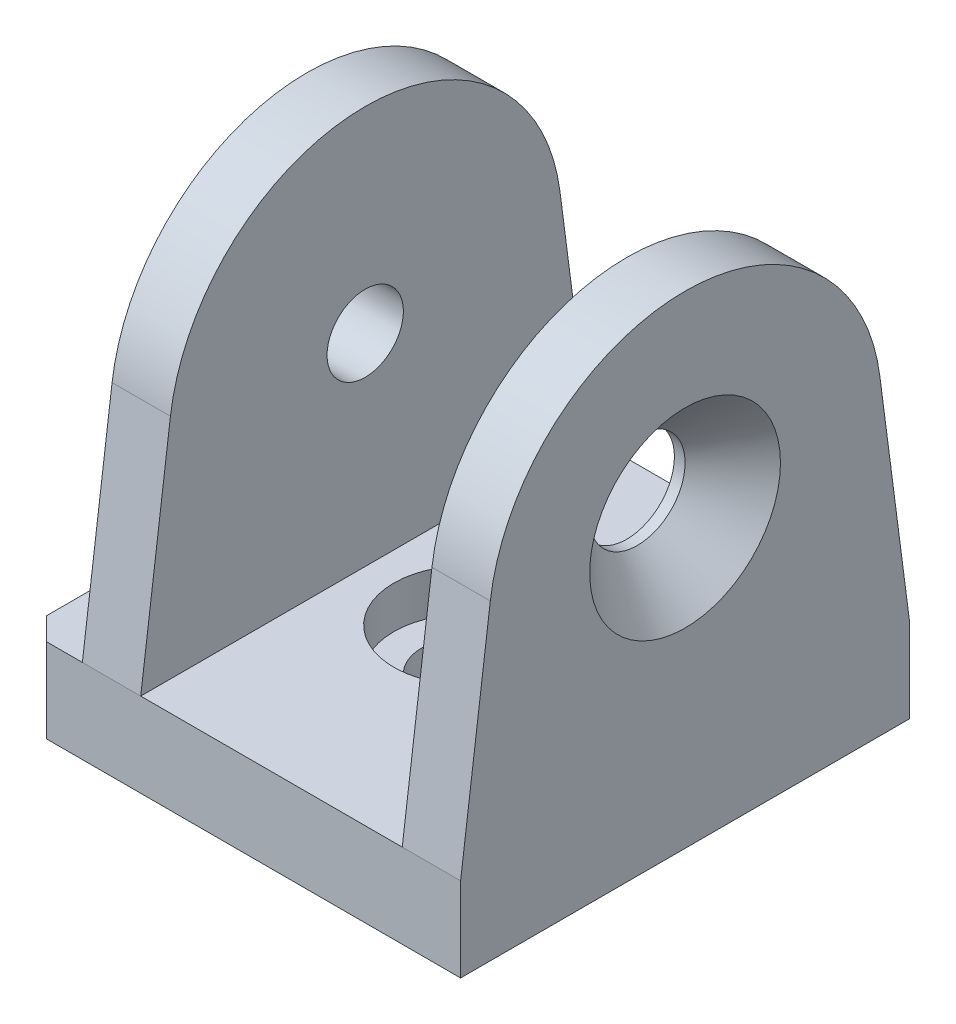
ISO-10303-21;
HEADER;
FILE_DESCRIPTION(('STEP AP214'),'2;1');
FILE_NAME('part.step','',(''),(''),'','','');
FILE_SCHEMA(('AUTOMOTIVE_DESIGN { 1 0 10303 214 1 1 1 1 }'));
ENDSEC;
DATA;
#1=APPLICATION_CONTEXT('core data for automotive mechanical design processes');
#2=APPLICATION_PROTOCOL_DEFINITION('international standard','automotive_design',2000,#1);
#3=PRODUCT_CONTEXT('',#1,'mechanical');
#4=PRODUCT('Part','Part','',(#3));
#5=PRODUCT_RELATED_PRODUCT_CATEGORY('part','',(#4));
#6=PRODUCT_DEFINITION_FORMATION('','',#4);
#7=PRODUCT_DEFINITION_CONTEXT('part definition',#1,'design');
#8=PRODUCT_DEFINITION('design','',#6,#7);
#9=PRODUCT_DEFINITION_SHAPE('','',#8);
#10=(LENGTH_UNIT() NAMED_UNIT(*) SI_UNIT(.MILLI.,.METRE.));
#11=(NAMED_UNIT(*) PLANE_ANGLE_UNIT() SI_UNIT($,.RADIAN.));
#12=(NAMED_UNIT(*) SI_UNIT($,.STERADIAN.) SOLID_ANGLE_UNIT());
#13=UNCERTAINTY_MEASURE_WITH_UNIT(LENGTH_MEASURE(1.E-05),#10,'distance_accuracy_value','');
#14=(GEOMETRIC_REPRESENTATION_CONTEXT(3) GLOBAL_UNCERTAINTY_ASSIGNED_CONTEXT((#13)) GLOBAL_UNIT_ASSIGNED_CONTEXT((#10,
#11,#12)) REPRESENTATION_CONTEXT('',''));
#15=CARTESIAN_POINT('',(0.,0.,0.));
#16=DIRECTION('',(0.,0.,1.));
#17=DIRECTION('',(1.,0.,0.));
#18=AXIS2_PLACEMENT_3D('',#15,#16,#17);
#19=CARTESIAN_POINT('',(-14.25,27.7667495892119,-17.3525746302907));
#20=DIRECTION('',(0.,0.129528547954965,-0.991575693159468));
#21=DIRECTION('',(0.,0.991575693159468,0.129528547954965));
#22=AXIS2_PLACEMENT_3D('',#19,#20,#21);
#23=PLANE('',#22);
#24=DIRECTION('',(0.,-0.991575693159468,-0.129528547954965));
#25=VECTOR('',#24,1.);
#26=CARTESIAN_POINT('',(14.25,27.7667495892119,-17.3525746302907));
#27=LINE('',#26,#25);
#28=CARTESIAN_POINT('',(14.25,27.7667495892119,-17.3525746302907));
#29=VERTEX_POINT('',#28);
#30=CARTESIAN_POINT('',(14.25,7.5,-20.));
#31=VERTEX_POINT('',#30);
#32=EDGE_CURVE('E145',#29,#31,#27,.T.);
#33=ORIENTED_EDGE('',*,*,#32,.F.);
#34=DIRECTION('',(1.,0.,0.));
#35=VECTOR('',#34,1.);
#36=CARTESIAN_POINT('',(-14.25,27.7667495892119,-17.3525746302907));
#37=LINE('',#36,#35);
#38=CARTESIAN_POINT('',(19.45,27.7667495892119,-17.3525746302907));
#39=VERTEX_POINT('',#38);
#40=EDGE_CURVE('E190',#29,#39,#37,.T.);
#41=ORIENTED_EDGE('',*,*,#40,.T.);
#42=DIRECTION('',(0.,0.991575693159467,0.129528547954965));
#43=VECTOR('',#42,1.);
#44=CARTESIAN_POINT('',(19.45,27.7667495892119,-17.3525746302907));
#45=LINE('',#44,#43);
#46=CARTESIAN_POINT('',(19.45,7.5,-20.));
#47=VERTEX_POINT('',#46);
#48=EDGE_CURVE('E258',#47,#39,#45,.T.);
#49=ORIENTED_EDGE('',*,*,#48,.F.);
#50=DIRECTION('',(-1.,0.,0.));
#51=VECTOR('',#50,1.);
#52=CARTESIAN_POINT('',(19.45,7.5,-20.));
#53=LINE('',#52,#51);
#54=EDGE_CURVE('E211',#47,#31,#53,.T.);
#55=ORIENTED_EDGE('',*,*,#54,.T.);
#56=EDGE_LOOP('',(#33,#41,#49,#55));
#57=FACE_BOUND('',#56,.T.);
#58=ADVANCED_FACE('F39',(#57),#23,.T.);
#59=CARTESIAN_POINT('',(-14.25,25.5,0.));
#60=DIRECTION('',(1.,0.,0.));
#61=DIRECTION('',(0.,0.,-1.));
#62=AXIS2_PLACEMENT_3D('',#59,#60,#61);
#63=CYLINDRICAL_SURFACE('',#62,17.5);
#64=DIRECTION('',(1.,0.,0.));
#65=VECTOR('',#64,1.);
#66=CARTESIAN_POINT('',(-14.25,27.7667495892119,17.3525746302907));
#67=LINE('',#66,#65);
#68=CARTESIAN_POINT('',(-14.25,27.7667495892119,17.3525746302907));
#69=VERTEX_POINT('',#68);
#70=CARTESIAN_POINT('',(-9.05000000000001,27.7667495892119,17.3525746302907));
#71=VERTEX_POINT('',#70);
#72=EDGE_CURVE('E178',#69,#71,#67,.T.);
#73=ORIENTED_EDGE('',*,*,#72,.T.);
#74=CARTESIAN_POINT('',(-9.05000000000001,25.5,0.));
#75=DIRECTION('',(-1.,0.,0.));
#76=DIRECTION('',(0.,-1.,0.));
#77=AXIS2_PLACEMENT_3D('',#74,#75,#76);
#78=CIRCLE('',#77,17.5);
#79=CARTESIAN_POINT('',(-9.05000000000001,27.7667495892119,-17.3525746302907));
#80=VERTEX_POINT('',#79);
#81=EDGE_CURVE('E149',#80,#71,#78,.F.);
#82=ORIENTED_EDGE('',*,*,#81,.F.);
#83=CARTESIAN_POINT('',(-14.25,27.7667495892119,-17.3525746302907));
#84=VERTEX_POINT('',#83);
#85=EDGE_CURVE('E187',#84,#80,#37,.T.);
#86=ORIENTED_EDGE('',*,*,#85,.F.);
#87=CARTESIAN_POINT('',(-14.25,25.5,0.));
#88=DIRECTION('',(1.,0.,0.));
#89=DIRECTION('',(0.,0.,1.));
#90=AXIS2_PLACEMENT_3D('',#87,#88,#89);
#91=CIRCLE('',#90,17.5);
#92=EDGE_CURVE('E313',#84,#69,#91,.T.);
#93=ORIENTED_EDGE('',*,*,#92,.T.);
#94=EDGE_LOOP('',(#73,#82,#86,#93));
#95=FACE_BOUND('',#94,.T.);
#96=ADVANCED_FACE('F273',(#95),#63,.T.);
#97=CARTESIAN_POINT('',(-14.25,7.5,20.));
#98=DIRECTION('',(0.,0.129528547954964,0.991575693159468));
#99=DIRECTION('',(0.,-0.991575693159468,0.129528547954964));
#100=AXIS2_PLACEMENT_3D('',#97,#98,#99);
#101=PLANE('',#100);
#102=DIRECTION('',(0.,0.991575693159468,-0.129528547954964));
#103=VECTOR('',#102,1.);
#104=CARTESIAN_POINT('',(14.25,7.5,20.));
#105=LINE('',#104,#103);
#106=CARTESIAN_POINT('',(14.25,7.5,20.));
#107=VERTEX_POINT('',#106);
#108=CARTESIAN_POINT('',(14.25,27.7667495892119,17.3525746302907));
#109=VERTEX_POINT('',#108);
#110=EDGE_CURVE('E142',#107,#109,#105,.T.);
#111=ORIENTED_EDGE('',*,*,#110,.F.);
#112=DIRECTION('',(1.,0.,0.));
#113=VECTOR('',#112,1.);
#114=CARTESIAN_POINT('',(-14.25,7.5,20.));
#115=LINE('',#114,#113);
#116=CARTESIAN_POINT('',(19.45,7.5,20.));
#117=VERTEX_POINT('',#116);
#118=EDGE_CURVE('E167',#107,#117,#115,.T.);
#119=ORIENTED_EDGE('',*,*,#118,.T.);
#120=DIRECTION('',(0.,-0.991575693159467,0.129528547954964));
#121=VECTOR('',#120,1.);
#122=CARTESIAN_POINT('',(19.45,7.5,20.));
#123=LINE('',#122,#121);
#124=CARTESIAN_POINT('',(19.45,27.7667495892119,17.3525746302907));
#125=VERTEX_POINT('',#124);
#126=EDGE_CURVE('E184',#125,#117,#123,.T.);
#127=ORIENTED_EDGE('',*,*,#126,.F.);
#128=EDGE_CURVE('E169',#109,#125,#67,.T.);
#129=ORIENTED_EDGE('',*,*,#128,.F.);
#130=EDGE_LOOP('',(#111,#119,#127,#129));
#131=FACE_BOUND('',#130,.T.);
#132=ADVANCED_FACE('F165',(#131),#101,.T.);
#133=CARTESIAN_POINT('',(0.,7.5,0.));
#134=DIRECTION('',(0.,1.,0.));
#135=DIRECTION('',(0.,0.,1.));
#136=AXIS2_PLACEMENT_3D('',#133,#134,#135);
#137=PLANE('',#136);
#138=CARTESIAN_POINT('',(-14.25,7.5,-20.));
#139=VERTEX_POINT('',#138);
#140=CARTESIAN_POINT('',(-17.45,7.5,-20.));
#141=VERTEX_POINT('',#140);
#142=EDGE_CURVE('E210',#139,#141,#53,.T.);
#143=ORIENTED_EDGE('',*,*,#142,.T.);
#144=DIRECTION('',(0.707106781186549,0.,-0.707106781186546));
#145=VECTOR('',#144,1.);
#146=CARTESIAN_POINT('',(-18.725,7.5,-18.725));
#147=LINE('',#146,#145);
#148=CARTESIAN_POINT('',(-19.45,7.5,-18.));
#149=VERTEX_POINT('',#148);
#150=EDGE_CURVE('E48',#141,#149,#147,.F.);
#151=ORIENTED_EDGE('',*,*,#150,.T.);
#152=DIRECTION('',(0.,0.,1.));
#153=VECTOR('',#152,1.);
#154=CARTESIAN_POINT('',(-19.45,7.5,20.));
#155=LINE('',#154,#153);
#156=CARTESIAN_POINT('',(-19.45,7.5,18.));
#157=VERTEX_POINT('',#156);
#158=EDGE_CURVE('E205',#149,#157,#155,.T.);
#159=ORIENTED_EDGE('',*,*,#158,.T.);
#160=DIRECTION('',(-0.707106781186546,0.,-0.707106781186549));
#161=VECTOR('',#160,1.);
#162=CARTESIAN_POINT('',(-18.725,7.5,18.725));
#163=LINE('',#162,#161);
#164=CARTESIAN_POINT('',(-17.45,7.5,20.));
#165=VERTEX_POINT('',#164);
#166=EDGE_CURVE('E55',#157,#165,#163,.F.);
#167=ORIENTED_EDGE('',*,*,#166,.T.);
#168=DIRECTION('',(1.,0.,0.));
#169=VECTOR('',#168,1.);
#170=CARTESIAN_POINT('',(19.45,7.5,20.));
#171=LINE('',#170,#169);
#172=CARTESIAN_POINT('',(-14.25,7.5,20.));
#173=VERTEX_POINT('',#172);
#174=EDGE_CURVE('E207',#165,#173,#171,.T.);
#175=ORIENTED_EDGE('',*,*,#174,.T.);
#176=DIRECTION('',(0.,0.,-1.));
#177=VECTOR('',#176,1.);
#178=CARTESIAN_POINT('',(-14.25,7.5,-20.));
#179=LINE('',#178,#177);
#180=EDGE_CURVE('E318',#173,#139,#179,.T.);
#181=ORIENTED_EDGE('',*,*,#180,.T.);
#182=EDGE_LOOP('',(#143,#151,#159,#167,#175,#181));
#183=FACE_BOUND('',#182,.T.);
#184=ADVANCED_FACE('F238',(#183),#137,.T.);
#185=CARTESIAN_POINT('',(-19.45,7.5,20.));
#186=DIRECTION('',(1.,0.,0.));
#187=DIRECTION('',(0.,0.,-1.));
#188=AXIS2_PLACEMENT_3D('',#185,#186,#187);
#189=PLANE('',#188);
#190=ORIENTED_EDGE('',*,*,#158,.F.);
#191=DIRECTION('',(0.,-1.,0.));
#192=VECTOR('',#191,1.);
#193=CARTESIAN_POINT('',(-19.45,7.5,-18.));
#194=LINE('',#193,#192);
#195=CARTESIAN_POINT('',(-19.45,0.,-18.));
#196=VERTEX_POINT('',#195);
#197=EDGE_CURVE('E228',#149,#196,#194,.T.);
#198=ORIENTED_EDGE('',*,*,#197,.T.);
#199=DIRECTION('',(0.,0.,1.));
#200=VECTOR('',#199,1.);
#201=CARTESIAN_POINT('',(-19.45,0.,20.));
#202=LINE('',#201,#200);
#203=CARTESIAN_POINT('',(-19.45,0.,18.));
#204=VERTEX_POINT('',#203);
#205=EDGE_CURVE('E204',#196,#204,#202,.T.);
#206=ORIENTED_EDGE('',*,*,#205,.T.);
#207=DIRECTION('',(0.,1.,0.));
#208=VECTOR('',#207,1.);
#209=CARTESIAN_POINT('',(-19.45,7.5,18.));
#210=LINE('',#209,#208);
#211=EDGE_CURVE('E170',#204,#157,#210,.T.);
#212=ORIENTED_EDGE('',*,*,#211,.T.);
#213=EDGE_LOOP('',(#190,#198,#206,#212));
#214=FACE_BOUND('',#213,.T.);
#215=ADVANCED_FACE('F243',(#214),#189,.F.);
#216=CARTESIAN_POINT('',(19.45,7.5,20.));
#217=DIRECTION('',(0.,0.,-1.));
#218=DIRECTION('',(-1.,0.,0.));
#219=AXIS2_PLACEMENT_3D('',#216,#217,#218);
#220=PLANE('',#219);
#221=ORIENTED_EDGE('',*,*,#174,.F.);
#222=DIRECTION('',(0.,-1.,0.));
#223=VECTOR('',#222,1.);
#224=CARTESIAN_POINT('',(-17.45,7.5,20.));
#225=LINE('',#224,#223);
#226=CARTESIAN_POINT('',(-17.45,0.,20.));
#227=VERTEX_POINT('',#226);
#228=EDGE_CURVE('E11',#165,#227,#225,.T.);
#229=ORIENTED_EDGE('',*,*,#228,.T.);
#230=DIRECTION('',(1.,0.,0.));
#231=VECTOR('',#230,1.);
#232=CARTESIAN_POINT('',(19.45,0.,20.));
#233=LINE('',#232,#231);
#234=CARTESIAN_POINT('',(19.45,0.,20.));
#235=VERTEX_POINT('',#234);
#236=EDGE_CURVE('E218',#227,#235,#233,.T.);
#237=ORIENTED_EDGE('',*,*,#236,.T.);
#238=DIRECTION('',(0.,-1.,0.));
#239=VECTOR('',#238,1.);
#240=CARTESIAN_POINT('',(19.45,7.5,20.));
#241=LINE('',#240,#239);
#242=EDGE_CURVE('E176',#117,#235,#241,.T.);
#243=ORIENTED_EDGE('',*,*,#242,.F.);
#244=ORIENTED_EDGE('',*,*,#118,.F.);
#245=DIRECTION('',(1.,0.,0.));
#246=VECTOR('',#245,1.);
#247=CARTESIAN_POINT('',(14.25,7.5,20.));
#248=LINE('',#247,#246);
#249=CARTESIAN_POINT('',(-9.05000000000001,7.5,20.));
#250=VERTEX_POINT('',#249);
#251=EDGE_CURVE('E153',#250,#107,#248,.T.);
#252=ORIENTED_EDGE('',*,*,#251,.F.);
#253=EDGE_CURVE('E177',#173,#250,#115,.T.);
#254=ORIENTED_EDGE('',*,*,#253,.F.);
#255=EDGE_LOOP('',(#221,#229,#237,#243,#244,#252,#254));
#256=FACE_BOUND('',#255,.T.);
#257=ADVANCED_FACE('F174',(#256),#220,.F.);
#258=CARTESIAN_POINT('',(19.45,7.5,20.));
#259=DIRECTION('',(-1.,0.,0.));
#260=DIRECTION('',(0.,0.,1.));
#261=AXIS2_PLACEMENT_3D('',#258,#259,#260);
#262=PLANE('',#261);
#263=CARTESIAN_POINT('',(19.45,25.5,0.));
#264=DIRECTION('',(1.,0.,0.));
#265=DIRECTION('',(0.,0.,-1.));
#266=AXIS2_PLACEMENT_3D('',#263,#264,#265);
#267=CIRCLE('',#266,8.5);
#268=CARTESIAN_POINT('',(19.45,25.5,-8.5));
#269=VERTEX_POINT('',#268);
#270=EDGE_CURVE('E328',#269,#269,#267,.T.);
#271=ORIENTED_EDGE('',*,*,#270,.F.);
#272=EDGE_LOOP('',(#271));
#273=FACE_BOUND('',#272,.T.);
#274=DIRECTION('',(0.,0.,-1.));
#275=VECTOR('',#274,1.);
#276=CARTESIAN_POINT('',(19.45,0.,20.));
#277=LINE('',#276,#275);
#278=CARTESIAN_POINT('',(19.45,0.,-20.));
#279=VERTEX_POINT('',#278);
#280=EDGE_CURVE('E220',#235,#279,#277,.T.);
#281=ORIENTED_EDGE('',*,*,#280,.T.);
#282=DIRECTION('',(0.,-1.,0.));
#283=VECTOR('',#282,1.);
#284=CARTESIAN_POINT('',(19.45,7.5,-20.));
#285=LINE('',#284,#283);
#286=EDGE_CURVE('E214',#47,#279,#285,.T.);
#287=ORIENTED_EDGE('',*,*,#286,.F.);
#288=ORIENTED_EDGE('',*,*,#48,.T.);
#289=CARTESIAN_POINT('',(19.45,25.5,0.));
#290=DIRECTION('',(1.,0.,0.));
#291=DIRECTION('',(0.,0.,1.));
#292=AXIS2_PLACEMENT_3D('',#289,#290,#291);
#293=CIRCLE('',#292,17.5);
#294=EDGE_CURVE('E306',#39,#125,#293,.T.);
#295=ORIENTED_EDGE('',*,*,#294,.T.);
#296=ORIENTED_EDGE('',*,*,#126,.T.);
#297=ORIENTED_EDGE('',*,*,#242,.T.);
#298=EDGE_LOOP('',(#281,#287,#288,#295,#296,#297));
#299=FACE_BOUND('',#298,.T.);
#300=ADVANCED_FACE('F256',(#273,#299),#262,.F.);
#301=CARTESIAN_POINT('',(19.45,7.5,-20.));
#302=DIRECTION('',(0.,0.,1.));
#303=DIRECTION('',(1.,0.,0.));
#304=AXIS2_PLACEMENT_3D('',#301,#302,#303);
#305=PLANE('',#304);
#306=DIRECTION('',(-1.,0.,0.));
#307=VECTOR('',#306,1.);
#308=CARTESIAN_POINT('',(19.45,0.,-20.));
#309=LINE('',#308,#307);
#310=CARTESIAN_POINT('',(-17.45,0.,-20.));
#311=VERTEX_POINT('',#310);
#312=EDGE_CURVE('E208',#279,#311,#309,.T.);
#313=ORIENTED_EDGE('',*,*,#312,.T.);
#314=DIRECTION('',(0.,1.,0.));
#315=VECTOR('',#314,1.);
#316=CARTESIAN_POINT('',(-17.45,7.5,-20.));
#317=LINE('',#316,#315);
#318=EDGE_CURVE('E63',#311,#141,#317,.T.);
#319=ORIENTED_EDGE('',*,*,#318,.T.);
#320=ORIENTED_EDGE('',*,*,#142,.F.);
#321=CARTESIAN_POINT('',(-9.05,7.5,-20.));
#322=VERTEX_POINT('',#321);
#323=EDGE_CURVE('E215',#322,#139,#53,.T.);
#324=ORIENTED_EDGE('',*,*,#323,.F.);
#325=DIRECTION('',(1.,0.,0.));
#326=VECTOR('',#325,1.);
#327=CARTESIAN_POINT('',(14.25,7.5,-20.));
#328=LINE('',#327,#326);
#329=EDGE_CURVE('E161',#322,#31,#328,.T.);
#330=ORIENTED_EDGE('',*,*,#329,.T.);
#331=ORIENTED_EDGE('',*,*,#54,.F.);
#332=ORIENTED_EDGE('',*,*,#286,.T.);
#333=EDGE_LOOP('',(#313,#319,#320,#324,#330,#331,#332));
#334=FACE_BOUND('',#333,.T.);
#335=ADVANCED_FACE('F251',(#334),#305,.F.);
#336=CARTESIAN_POINT('',(0.,0.,0.));
#337=DIRECTION('',(0.,1.,0.));
#338=DIRECTION('',(0.,0.,1.));
#339=AXIS2_PLACEMENT_3D('',#336,#337,#338);
#340=PLANE('',#339);
#341=CARTESIAN_POINT('',(0.,0.,0.));
#342=DIRECTION('',(0.,1.,0.));
#343=DIRECTION('',(-1.,0.,0.));
#344=AXIS2_PLACEMENT_3D('',#341,#342,#343);
#345=CIRCLE('',#344,4.);
#346=CARTESIAN_POINT('',(-4.,0.,0.));
#347=VERTEX_POINT('',#346);
#348=EDGE_CURVE('E201',#347,#347,#345,.T.);
#349=ORIENTED_EDGE('',*,*,#348,.T.);
#350=EDGE_LOOP('',(#349));
#351=FACE_BOUND('',#350,.T.);
#352=ORIENTED_EDGE('',*,*,#205,.F.);
#353=DIRECTION('',(-0.707106781186549,0.,0.707106781186546));
#354=VECTOR('',#353,1.);
#355=CARTESIAN_POINT('',(-19.45,0.,-18.));
#356=LINE('',#355,#354);
#357=EDGE_CURVE('E233',#196,#311,#356,.F.);
#358=ORIENTED_EDGE('',*,*,#357,.T.);
#359=ORIENTED_EDGE('',*,*,#312,.F.);
#360=ORIENTED_EDGE('',*,*,#280,.F.);
#361=ORIENTED_EDGE('',*,*,#236,.F.);
#362=DIRECTION('',(0.707106781186546,0.,0.707106781186549));
#363=VECTOR('',#362,1.);
#364=CARTESIAN_POINT('',(-17.45,0.,20.));
#365=LINE('',#364,#363);
#366=EDGE_CURVE('E231',#227,#204,#365,.F.);
#367=ORIENTED_EDGE('',*,*,#366,.T.);
#368=EDGE_LOOP('',(#352,#358,#359,#360,#361,#367));
#369=FACE_BOUND('',#368,.T.);
#370=ADVANCED_FACE('F249',(#351,#369),#340,.F.);
#371=CARTESIAN_POINT('',(0.,7.5,0.));
#372=DIRECTION('',(0.,1.,0.));
#373=DIRECTION('',(-1.,0.,0.));
#374=AXIS2_PLACEMENT_3D('',#371,#372,#373);
#375=CYLINDRICAL_SURFACE('',#374,4.);
#376=ORIENTED_EDGE('',*,*,#348,.F.);
#377=EDGE_LOOP('',(#376));
#378=FACE_BOUND('',#377,.T.);
#379=CARTESIAN_POINT('',(0.,3.75,0.));
#380=DIRECTION('',(0.,1.,0.));
#381=DIRECTION('',(-1.,0.,0.));
#382=AXIS2_PLACEMENT_3D('',#379,#380,#381);
#383=CIRCLE('',#382,4.);
#384=CARTESIAN_POINT('',(-4.,3.75,0.));
#385=VERTEX_POINT('',#384);
#386=EDGE_CURVE('E198',#385,#385,#383,.T.);
#387=ORIENTED_EDGE('',*,*,#386,.T.);
#388=EDGE_LOOP('',(#387));
#389=FACE_BOUND('',#388,.T.);
#390=ADVANCED_FACE('F370',(#378,#389),#375,.F.);
#391=CARTESIAN_POINT('',(-4.,3.75,0.));
#392=DIRECTION('',(0.,-1.,0.));
#393=DIRECTION('',(1.,0.,0.));
#394=AXIS2_PLACEMENT_3D('',#391,#392,#393);
#395=PLANE('',#394);
#396=ORIENTED_EDGE('',*,*,#386,.F.);
#397=EDGE_LOOP('',(#396));
#398=FACE_BOUND('',#397,.T.);
#399=CARTESIAN_POINT('',(0.,3.75000000000001,0.));
#400=DIRECTION('',(0.,1.,0.));
#401=DIRECTION('',(-1.,0.,0.));
#402=AXIS2_PLACEMENT_3D('',#399,#400,#401);
#403=CIRCLE('',#402,6.5);
#404=CARTESIAN_POINT('',(-6.5,3.75,0.));
#405=VERTEX_POINT('',#404);
#406=EDGE_CURVE('E180',#405,#405,#403,.T.);
#407=ORIENTED_EDGE('',*,*,#406,.T.);
#408=EDGE_LOOP('',(#407));
#409=FACE_BOUND('',#408,.T.);
#410=ADVANCED_FACE('F410',(#398,#409),#395,.F.);
#411=CARTESIAN_POINT('',(0.,7.5,0.));
#412=DIRECTION('',(0.,1.,0.));
#413=DIRECTION('',(-1.,0.,0.));
#414=AXIS2_PLACEMENT_3D('',#411,#412,#413);
#415=CYLINDRICAL_SURFACE('',#414,6.5);
#416=ORIENTED_EDGE('',*,*,#406,.F.);
#417=EDGE_LOOP('',(#416));
#418=FACE_BOUND('',#417,.T.);
#419=CARTESIAN_POINT('',(0.,7.50000000000001,0.));
#420=DIRECTION('',(0.,1.,0.));
#421=DIRECTION('',(-1.,0.,0.));
#422=AXIS2_PLACEMENT_3D('',#419,#420,#421);
#423=CIRCLE('',#422,6.5);
#424=CARTESIAN_POINT('',(-6.5,7.5,0.));
#425=VERTEX_POINT('',#424);
#426=EDGE_CURVE('E191',#425,#425,#423,.T.);
#427=ORIENTED_EDGE('',*,*,#426,.T.);
#428=EDGE_LOOP('',(#427));
#429=FACE_BOUND('',#428,.T.);
#430=ADVANCED_FACE('F293',(#418,#429),#415,.F.);
#431=CARTESIAN_POINT('',(-14.25,25.5,0.));
#432=DIRECTION('',(-1.,0.,0.));
#433=DIRECTION('',(0.,0.,1.));
#434=AXIS2_PLACEMENT_3D('',#431,#432,#433);
#435=PLANE('',#434);
#436=CARTESIAN_POINT('',(-14.25,25.5,0.));
#437=DIRECTION('',(-1.,0.,0.));
#438=DIRECTION('',(0.,0.,1.));
#439=AXIS2_PLACEMENT_3D('',#436,#437,#438);
#440=CIRCLE('',#439,3.4);
#441=CARTESIAN_POINT('',(-14.25,25.5,3.4));
#442=VERTEX_POINT('',#441);
#443=EDGE_CURVE('E334',#442,#442,#440,.T.);
#444=ORIENTED_EDGE('',*,*,#443,.F.);
#445=EDGE_LOOP('',(#444));
#446=FACE_BOUND('',#445,.T.);
#447=ORIENTED_EDGE('',*,*,#180,.F.);
#448=DIRECTION('',(0.,-0.991575693159467,0.129528547954964));
#449=VECTOR('',#448,1.);
#450=CARTESIAN_POINT('',(-14.25,7.5,20.));
#451=LINE('',#450,#449);
#452=EDGE_CURVE('E310',#69,#173,#451,.T.);
#453=ORIENTED_EDGE('',*,*,#452,.F.);
#454=ORIENTED_EDGE('',*,*,#92,.F.);
#455=DIRECTION('',(0.,0.991575693159467,0.129528547954965));
#456=VECTOR('',#455,1.);
#457=CARTESIAN_POINT('',(-14.25,27.7667495892119,-17.3525746302907));
#458=LINE('',#457,#456);
#459=EDGE_CURVE('E316',#139,#84,#458,.T.);
#460=ORIENTED_EDGE('',*,*,#459,.F.);
#461=EDGE_LOOP('',(#447,#453,#454,#460));
#462=FACE_BOUND('',#461,.T.);
#463=ADVANCED_FACE('F285',(#446,#462),#435,.T.);
#464=DIRECTION('',(0.,0.991575693159468,0.129528547954965));
#465=VECTOR('',#464,1.);
#466=CARTESIAN_POINT('',(-9.05000000000001,27.7667495892119,-17.3525746302907));
#467=LINE('',#466,#465);
#468=EDGE_CURVE('E195',#322,#80,#467,.T.);
#469=ORIENTED_EDGE('',*,*,#468,.F.);
#470=ORIENTED_EDGE('',*,*,#323,.T.);
#471=ORIENTED_EDGE('',*,*,#459,.T.);
#472=ORIENTED_EDGE('',*,*,#85,.T.);
#473=EDGE_LOOP('',(#469,#470,#471,#472));
#474=FACE_BOUND('',#473,.T.);
#475=ADVANCED_FACE('F276',(#474),#23,.T.);
#476=CARTESIAN_POINT('',(14.25,25.5,0.));
#477=DIRECTION('',(1.,0.,0.));
#478=DIRECTION('',(0.,0.,-1.));
#479=AXIS2_PLACEMENT_3D('',#476,#477,#478);
#480=CIRCLE('',#479,17.5);
#481=EDGE_CURVE('E194',#109,#29,#480,.F.);
#482=ORIENTED_EDGE('',*,*,#481,.F.);
#483=ORIENTED_EDGE('',*,*,#128,.T.);
#484=ORIENTED_EDGE('',*,*,#294,.F.);
#485=ORIENTED_EDGE('',*,*,#40,.F.);
#486=EDGE_LOOP('',(#482,#483,#484,#485));
#487=FACE_BOUND('',#486,.T.);
#488=ADVANCED_FACE('F282',(#487),#63,.T.);
#489=DIRECTION('',(0.,-0.991575693159468,0.129528547954964));
#490=VECTOR('',#489,1.);
#491=CARTESIAN_POINT('',(-9.05,7.5,20.));
#492=LINE('',#491,#490);
#493=EDGE_CURVE('E171',#71,#250,#492,.T.);
#494=ORIENTED_EDGE('',*,*,#493,.F.);
#495=ORIENTED_EDGE('',*,*,#72,.F.);
#496=ORIENTED_EDGE('',*,*,#452,.T.);
#497=ORIENTED_EDGE('',*,*,#253,.T.);
#498=EDGE_LOOP('',(#494,#495,#496,#497));
#499=FACE_BOUND('',#498,.T.);
#500=ADVANCED_FACE('F291',(#499),#101,.T.);
#501=CARTESIAN_POINT('',(14.25,7.5,-20.));
#502=DIRECTION('',(0.,-1.,0.));
#503=DIRECTION('',(1.,0.,0.));
#504=AXIS2_PLACEMENT_3D('',#501,#502,#503);
#505=PLANE('',#504);
#506=DIRECTION('',(0.,0.,1.));
#507=VECTOR('',#506,1.);
#508=CARTESIAN_POINT('',(14.25,7.5,-20.));
#509=LINE('',#508,#507);
#510=EDGE_CURVE('E138',#31,#107,#509,.T.);
#511=ORIENTED_EDGE('',*,*,#510,.F.);
#512=ORIENTED_EDGE('',*,*,#329,.F.);
#513=DIRECTION('',(0.,0.,1.));
#514=VECTOR('',#513,1.);
#515=CARTESIAN_POINT('',(-9.05,7.5,-20.));
#516=LINE('',#515,#514);
#517=EDGE_CURVE('E150',#322,#250,#516,.T.);
#518=ORIENTED_EDGE('',*,*,#517,.T.);
#519=ORIENTED_EDGE('',*,*,#251,.T.);
#520=EDGE_LOOP('',(#511,#512,#518,#519));
#521=FACE_BOUND('',#520,.T.);
#522=ORIENTED_EDGE('',*,*,#426,.F.);
#523=EDGE_LOOP('',(#522));
#524=FACE_BOUND('',#523,.T.);
#525=ADVANCED_FACE('F154',(#521,#524),#505,.F.);
#526=CARTESIAN_POINT('',(14.25,7.5,-20.));
#527=DIRECTION('',(1.,0.,0.));
#528=DIRECTION('',(0.,0.,-1.));
#529=AXIS2_PLACEMENT_3D('',#526,#527,#528);
#530=PLANE('',#529);
#531=CARTESIAN_POINT('',(14.25,25.5,0.));
#532=DIRECTION('',(1.,0.,0.));
#533=DIRECTION('',(0.,0.,-1.));
#534=AXIS2_PLACEMENT_3D('',#531,#532,#533);
#535=CIRCLE('',#534,4.25);
#536=CARTESIAN_POINT('',(14.25,25.5,-4.25));
#537=VERTEX_POINT('',#536);
#538=EDGE_CURVE('E162',#537,#537,#535,.T.);
#539=ORIENTED_EDGE('',*,*,#538,.T.);
#540=EDGE_LOOP('',(#539));
#541=FACE_BOUND('',#540,.T.);
#542=ORIENTED_EDGE('',*,*,#32,.T.);
#543=ORIENTED_EDGE('',*,*,#510,.T.);
#544=ORIENTED_EDGE('',*,*,#110,.T.);
#545=ORIENTED_EDGE('',*,*,#481,.T.);
#546=EDGE_LOOP('',(#542,#543,#544,#545));
#547=FACE_BOUND('',#546,.T.);
#548=ADVANCED_FACE('F140',(#541,#547),#530,.F.);
#549=CARTESIAN_POINT('',(-9.05,7.5,-20.));
#550=DIRECTION('',(-1.,0.,0.));
#551=DIRECTION('',(0.,-1.,0.));
#552=AXIS2_PLACEMENT_3D('',#549,#550,#551);
#553=PLANE('',#552);
#554=CARTESIAN_POINT('',(-9.05000000000001,25.5,0.));
#555=DIRECTION('',(-1.,0.,0.));
#556=DIRECTION('',(0.,-1.,0.));
#557=AXIS2_PLACEMENT_3D('',#554,#555,#556);
#558=CIRCLE('',#557,3.4);
#559=CARTESIAN_POINT('',(-9.05000000000001,22.1,0.));
#560=VERTEX_POINT('',#559);
#561=EDGE_CURVE('E331',#560,#560,#558,.T.);
#562=ORIENTED_EDGE('',*,*,#561,.T.);
#563=EDGE_LOOP('',(#562));
#564=FACE_BOUND('',#563,.T.);
#565=ORIENTED_EDGE('',*,*,#468,.T.);
#566=ORIENTED_EDGE('',*,*,#81,.T.);
#567=ORIENTED_EDGE('',*,*,#493,.T.);
#568=ORIENTED_EDGE('',*,*,#517,.F.);
#569=EDGE_LOOP('',(#565,#566,#567,#568));
#570=FACE_BOUND('',#569,.T.);
#571=ADVANCED_FACE('F271',(#564,#570),#553,.F.);
#572=CARTESIAN_POINT('',(-19.45,7.5,-18.));
#573=DIRECTION('',(0.707106781186546,0.,0.707106781186549));
#574=DIRECTION('',(0.,-1.,0.));
#575=AXIS2_PLACEMENT_3D('',#572,#573,#574);
#576=PLANE('',#575);
#577=ORIENTED_EDGE('',*,*,#150,.F.);
#578=ORIENTED_EDGE('',*,*,#318,.F.);
#579=ORIENTED_EDGE('',*,*,#357,.F.);
#580=ORIENTED_EDGE('',*,*,#197,.F.);
#581=EDGE_LOOP('',(#577,#578,#579,#580));
#582=FACE_BOUND('',#581,.T.);
#583=ADVANCED_FACE('F246',(#582),#576,.F.);
#584=CARTESIAN_POINT('',(-17.45,7.5,20.));
#585=DIRECTION('',(0.707106781186549,0.,-0.707106781186546));
#586=DIRECTION('',(0.,-1.,0.));
#587=AXIS2_PLACEMENT_3D('',#584,#585,#586);
#588=PLANE('',#587);
#589=ORIENTED_EDGE('',*,*,#166,.F.);
#590=ORIENTED_EDGE('',*,*,#211,.F.);
#591=ORIENTED_EDGE('',*,*,#366,.F.);
#592=ORIENTED_EDGE('',*,*,#228,.F.);
#593=EDGE_LOOP('',(#589,#590,#591,#592));
#594=FACE_BOUND('',#593,.T.);
#595=ADVANCED_FACE('F42',(#594),#588,.F.);
#596=CARTESIAN_POINT('',(19.45,25.5,0.));
#597=DIRECTION('',(1.,0.,0.));
#598=DIRECTION('',(0.,0.,-1.));
#599=AXIS2_PLACEMENT_3D('',#596,#597,#598);
#600=CYLINDRICAL_SURFACE('',#599,4.25);
#601=ORIENTED_EDGE('',*,*,#538,.F.);
#602=EDGE_LOOP('',(#601));
#603=FACE_BOUND('',#602,.T.);
#604=CARTESIAN_POINT('',(15.2,25.5,0.));
#605=DIRECTION('',(1.,0.,0.));
#606=DIRECTION('',(0.,0.,-1.));
#607=AXIS2_PLACEMENT_3D('',#604,#605,#606);
#608=CIRCLE('',#607,4.25);
#609=CARTESIAN_POINT('',(15.2,25.5,-4.25));
#610=VERTEX_POINT('',#609);
#611=EDGE_CURVE('E325',#610,#610,#608,.T.);
#612=ORIENTED_EDGE('',*,*,#611,.T.);
#613=EDGE_LOOP('',(#612));
#614=FACE_BOUND('',#613,.T.);
#615=ADVANCED_FACE('F263',(#603,#614),#600,.F.);
#616=CARTESIAN_POINT('',(19.45,25.5,0.));
#617=DIRECTION('',(1.,0.,0.));
#618=DIRECTION('',(0.,0.,-1.));
#619=AXIS2_PLACEMENT_3D('',#616,#617,#618);
#620=CONICAL_SURFACE('',#619,8.5,0.785398163397449);
#621=ORIENTED_EDGE('',*,*,#611,.F.);
#622=EDGE_LOOP('',(#621));
#623=FACE_BOUND('',#622,.T.);
#624=ORIENTED_EDGE('',*,*,#270,.T.);
#625=EDGE_LOOP('',(#624));
#626=FACE_BOUND('',#625,.T.);
#627=ADVANCED_FACE('F268',(#623,#626),#620,.F.);
#628=CARTESIAN_POINT('',(-14.25,25.5,0.));
#629=DIRECTION('',(-1.,0.,0.));
#630=DIRECTION('',(0.,0.,1.));
#631=AXIS2_PLACEMENT_3D('',#628,#629,#630);
#632=CYLINDRICAL_SURFACE('',#631,3.4);
#633=ORIENTED_EDGE('',*,*,#561,.F.);
#634=EDGE_LOOP('',(#633));
#635=FACE_BOUND('',#634,.T.);
#636=ORIENTED_EDGE('',*,*,#443,.T.);
#637=EDGE_LOOP('',(#636));
#638=FACE_BOUND('',#637,.T.);
#639=ADVANCED_FACE('F338',(#635,#638),#632,.F.);
#640=CLOSED_SHELL('',(#58,#96,#132,#184,#215,#257,#300,#335,#370,#390,#410,#430,#463,#475,#488,
#500,#525,#548,#571,#583,#595,#615,#627,#639));
#641=MANIFOLD_SOLID_BREP('B2',#640);
#642=ADVANCED_BREP_SHAPE_REPRESENTATION('',(#18,#641),#14);
#643=SHAPE_DEFINITION_REPRESENTATION(#9,#642);
ENDSEC;
END-ISO-10303-21;
